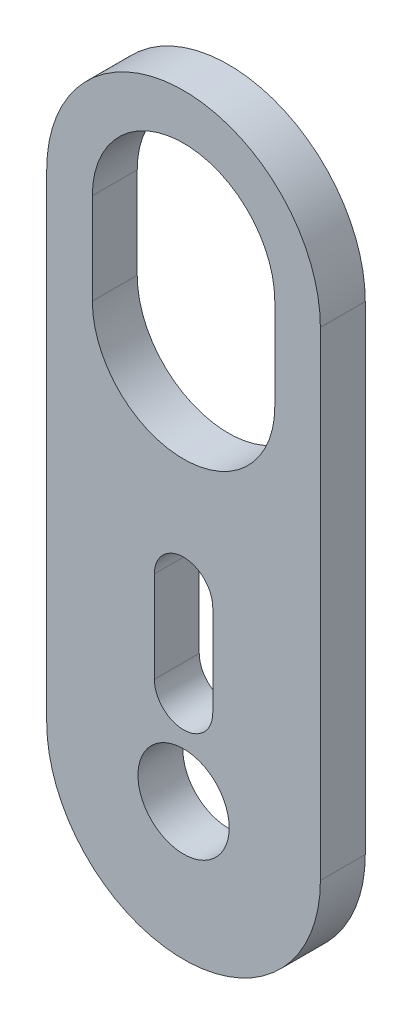
ISO-10303-21;
HEADER;
FILE_DESCRIPTION(('STEP AP214'),'2;1');
FILE_NAME('part.step','',(''),(''),'','','');
FILE_SCHEMA(('AUTOMOTIVE_DESIGN { 1 0 10303 214 1 1 1 1 }'));
ENDSEC;
DATA;
#1=APPLICATION_CONTEXT('core data for automotive mechanical design processes');
#2=APPLICATION_PROTOCOL_DEFINITION('international standard','automotive_design',2000,#1);
#3=PRODUCT_CONTEXT('',#1,'mechanical');
#4=PRODUCT('Part','Part','',(#3));
#5=PRODUCT_RELATED_PRODUCT_CATEGORY('part','',(#4));
#6=PRODUCT_DEFINITION_FORMATION('','',#4);
#7=PRODUCT_DEFINITION_CONTEXT('part definition',#1,'design');
#8=PRODUCT_DEFINITION('design','',#6,#7);
#9=PRODUCT_DEFINITION_SHAPE('','',#8);
#10=(LENGTH_UNIT() NAMED_UNIT(*) SI_UNIT(.MILLI.,.METRE.));
#11=(NAMED_UNIT(*) PLANE_ANGLE_UNIT() SI_UNIT($,.RADIAN.));
#12=(NAMED_UNIT(*) SI_UNIT($,.STERADIAN.) SOLID_ANGLE_UNIT());
#13=UNCERTAINTY_MEASURE_WITH_UNIT(LENGTH_MEASURE(1.E-05),#10,'distance_accuracy_value','');
#14=(GEOMETRIC_REPRESENTATION_CONTEXT(3) GLOBAL_UNCERTAINTY_ASSIGNED_CONTEXT((#13)) GLOBAL_UNIT_ASSIGNED_CONTEXT((#10,
#11,#12)) REPRESENTATION_CONTEXT('',''));
#15=CARTESIAN_POINT('',(0.,0.,0.));
#16=DIRECTION('',(0.,0.,1.));
#17=DIRECTION('',(1.,0.,0.));
#18=AXIS2_PLACEMENT_3D('',#15,#16,#17);
#19=CARTESIAN_POINT('',(0.,0.,3.1242));
#20=DIRECTION('',(0.,0.,1.));
#21=DIRECTION('',(1.,0.,0.));
#22=AXIS2_PLACEMENT_3D('',#19,#20,#21);
#23=PLANE('',#22);
#24=CARTESIAN_POINT('',(0.,0.,3.1242));
#25=DIRECTION('',(0.,0.,1.));
#26=DIRECTION('',(1.,0.,0.));
#27=AXIS2_PLACEMENT_3D('',#24,#25,#26);
#28=CIRCLE('',#27,9.525);
#29=CARTESIAN_POINT('',(-9.525,0.,3.1242));
#30=VERTEX_POINT('',#29);
#31=CARTESIAN_POINT('',(9.525,0.,3.1242));
#32=VERTEX_POINT('',#31);
#33=EDGE_CURVE('E197',#30,#32,#28,.T.);
#34=ORIENTED_EDGE('',*,*,#33,.T.);
#35=DIRECTION('',(0.,1.,0.));
#36=VECTOR('',#35,1.);
#37=CARTESIAN_POINT('',(9.525,0.,3.1242));
#38=LINE('',#37,#36);
#39=CARTESIAN_POINT('',(9.525,33.3375,3.1242));
#40=VERTEX_POINT('',#39);
#41=EDGE_CURVE('E200',#32,#40,#38,.T.);
#42=ORIENTED_EDGE('',*,*,#41,.T.);
#43=CARTESIAN_POINT('',(0.,33.3375,3.1242));
#44=DIRECTION('',(0.,0.,1.));
#45=DIRECTION('',(1.,0.,0.));
#46=AXIS2_PLACEMENT_3D('',#43,#44,#45);
#47=CIRCLE('',#46,9.525);
#48=CARTESIAN_POINT('',(-9.525,33.3375,3.1242));
#49=VERTEX_POINT('',#48);
#50=EDGE_CURVE('E203',#40,#49,#47,.T.);
#51=ORIENTED_EDGE('',*,*,#50,.T.);
#52=DIRECTION('',(0.,-1.,0.));
#53=VECTOR('',#52,1.);
#54=CARTESIAN_POINT('',(-9.525,0.,3.1242));
#55=LINE('',#54,#53);
#56=EDGE_CURVE('E205',#49,#30,#55,.T.);
#57=ORIENTED_EDGE('',*,*,#56,.T.);
#58=EDGE_LOOP('',(#34,#42,#51,#57));
#59=FACE_BOUND('',#58,.T.);
#60=CARTESIAN_POINT('',(0.,0.,3.1242));
#61=DIRECTION('',(0.,0.,1.));
#62=DIRECTION('',(1.,0.,0.));
#63=AXIS2_PLACEMENT_3D('',#60,#61,#62);
#64=CIRCLE('',#63,3.175);
#65=CARTESIAN_POINT('',(3.175,0.,3.1242));
#66=VERTEX_POINT('',#65);
#67=EDGE_CURVE('E191',#66,#66,#64,.T.);
#68=ORIENTED_EDGE('',*,*,#67,.F.);
#69=EDGE_LOOP('',(#68));
#70=FACE_BOUND('',#69,.T.);
#71=DIRECTION('',(0.,1.,0.));
#72=VECTOR('',#71,1.);
#73=CARTESIAN_POINT('',(2.032,6.35,3.1242));
#74=LINE('',#73,#72);
#75=CARTESIAN_POINT('',(2.032,6.35,3.1242));
#76=VERTEX_POINT('',#75);
#77=CARTESIAN_POINT('',(2.032,12.7,3.1242));
#78=VERTEX_POINT('',#77);
#79=EDGE_CURVE('E162',#76,#78,#74,.T.);
#80=ORIENTED_EDGE('',*,*,#79,.F.);
#81=CARTESIAN_POINT('',(0.,6.35,3.1242));
#82=DIRECTION('',(0.,0.,1.));
#83=DIRECTION('',(1.,0.,0.));
#84=AXIS2_PLACEMENT_3D('',#81,#82,#83);
#85=CIRCLE('',#84,2.032);
#86=CARTESIAN_POINT('',(-2.032,6.35,3.1242));
#87=VERTEX_POINT('',#86);
#88=EDGE_CURVE('E160',#87,#76,#85,.T.);
#89=ORIENTED_EDGE('',*,*,#88,.F.);
#90=DIRECTION('',(0.,-1.,0.));
#91=VECTOR('',#90,1.);
#92=CARTESIAN_POINT('',(-2.032,6.35,3.1242));
#93=LINE('',#92,#91);
#94=CARTESIAN_POINT('',(-2.032,12.7,3.1242));
#95=VERTEX_POINT('',#94);
#96=EDGE_CURVE('E168',#95,#87,#93,.T.);
#97=ORIENTED_EDGE('',*,*,#96,.F.);
#98=CARTESIAN_POINT('',(0.,12.7,3.1242));
#99=DIRECTION('',(0.,0.,1.));
#100=DIRECTION('',(1.,0.,0.));
#101=AXIS2_PLACEMENT_3D('',#98,#99,#100);
#102=CIRCLE('',#101,2.032);
#103=EDGE_CURVE('E165',#78,#95,#102,.T.);
#104=ORIENTED_EDGE('',*,*,#103,.F.);
#105=EDGE_LOOP('',(#80,#89,#97,#104));
#106=FACE_BOUND('',#105,.T.);
#107=DIRECTION('',(0.,-1.,0.));
#108=VECTOR('',#107,1.);
#109=CARTESIAN_POINT('',(-6.35,33.3375,3.1242));
#110=LINE('',#109,#108);
#111=CARTESIAN_POINT('',(-6.35,33.3375,3.1242));
#112=VERTEX_POINT('',#111);
#113=CARTESIAN_POINT('',(-6.35,26.9875,3.1242));
#114=VERTEX_POINT('',#113);
#115=EDGE_CURVE('E132',#112,#114,#110,.T.);
#116=ORIENTED_EDGE('',*,*,#115,.F.);
#117=CARTESIAN_POINT('',(0.,33.3375,3.1242));
#118=DIRECTION('',(0.,0.,1.));
#119=DIRECTION('',(1.,0.,0.));
#120=AXIS2_PLACEMENT_3D('',#117,#118,#119);
#121=CIRCLE('',#120,6.35);
#122=CARTESIAN_POINT('',(6.35,33.3375,3.1242));
#123=VERTEX_POINT('',#122);
#124=EDGE_CURVE('E124',#123,#112,#121,.T.);
#125=ORIENTED_EDGE('',*,*,#124,.F.);
#126=DIRECTION('',(0.,1.,0.));
#127=VECTOR('',#126,1.);
#128=CARTESIAN_POINT('',(6.35,33.3375,3.1242));
#129=LINE('',#128,#127);
#130=CARTESIAN_POINT('',(6.35,26.9875,3.1242));
#131=VERTEX_POINT('',#130);
#132=EDGE_CURVE('E146',#131,#123,#129,.T.);
#133=ORIENTED_EDGE('',*,*,#132,.F.);
#134=CARTESIAN_POINT('',(0.,26.9875,3.1242));
#135=DIRECTION('',(0.,0.,1.));
#136=DIRECTION('',(1.,0.,0.));
#137=AXIS2_PLACEMENT_3D('',#134,#135,#136);
#138=CIRCLE('',#137,6.35);
#139=EDGE_CURVE('E144',#114,#131,#138,.T.);
#140=ORIENTED_EDGE('',*,*,#139,.F.);
#141=EDGE_LOOP('',(#116,#125,#133,#140));
#142=FACE_BOUND('',#141,.T.);
#143=ADVANCED_FACE('F35',(#59,#70,#106,#142),#23,.T.);
#144=CARTESIAN_POINT('',(0.,0.,0.));
#145=DIRECTION('',(0.,0.,1.));
#146=DIRECTION('',(1.,0.,0.));
#147=AXIS2_PLACEMENT_3D('',#144,#145,#146);
#148=PLANE('',#147);
#149=CARTESIAN_POINT('',(0.,6.35,0.));
#150=DIRECTION('',(0.,0.,1.));
#151=DIRECTION('',(1.,0.,0.));
#152=AXIS2_PLACEMENT_3D('',#149,#150,#151);
#153=CIRCLE('',#152,2.032);
#154=CARTESIAN_POINT('',(-2.032,6.35,0.));
#155=VERTEX_POINT('',#154);
#156=CARTESIAN_POINT('',(2.032,6.35,0.));
#157=VERTEX_POINT('',#156);
#158=EDGE_CURVE('E140',#155,#157,#153,.T.);
#159=ORIENTED_EDGE('',*,*,#158,.T.);
#160=DIRECTION('',(0.,1.,0.));
#161=VECTOR('',#160,1.);
#162=CARTESIAN_POINT('',(2.032,6.35,0.));
#163=LINE('',#162,#161);
#164=CARTESIAN_POINT('',(2.032,12.7,0.));
#165=VERTEX_POINT('',#164);
#166=EDGE_CURVE('E173',#157,#165,#163,.T.);
#167=ORIENTED_EDGE('',*,*,#166,.T.);
#168=CARTESIAN_POINT('',(0.,12.7,0.));
#169=DIRECTION('',(0.,0.,1.));
#170=DIRECTION('',(1.,0.,0.));
#171=AXIS2_PLACEMENT_3D('',#168,#169,#170);
#172=CIRCLE('',#171,2.032);
#173=CARTESIAN_POINT('',(-2.032,12.7,0.));
#174=VERTEX_POINT('',#173);
#175=EDGE_CURVE('E176',#165,#174,#172,.T.);
#176=ORIENTED_EDGE('',*,*,#175,.T.);
#177=DIRECTION('',(0.,-1.,0.));
#178=VECTOR('',#177,1.);
#179=CARTESIAN_POINT('',(-2.032,6.35,0.));
#180=LINE('',#179,#178);
#181=EDGE_CURVE('E163',#174,#155,#180,.T.);
#182=ORIENTED_EDGE('',*,*,#181,.T.);
#183=EDGE_LOOP('',(#159,#167,#176,#182));
#184=FACE_BOUND('',#183,.T.);
#185=CARTESIAN_POINT('',(0.,0.,0.));
#186=DIRECTION('',(0.,0.,1.));
#187=DIRECTION('',(1.,0.,0.));
#188=AXIS2_PLACEMENT_3D('',#185,#186,#187);
#189=CIRCLE('',#188,9.525);
#190=CARTESIAN_POINT('',(-9.525,0.,0.));
#191=VERTEX_POINT('',#190);
#192=CARTESIAN_POINT('',(9.525,0.,0.));
#193=VERTEX_POINT('',#192);
#194=EDGE_CURVE('E194',#191,#193,#189,.T.);
#195=ORIENTED_EDGE('',*,*,#194,.F.);
#196=DIRECTION('',(0.,-1.,0.));
#197=VECTOR('',#196,1.);
#198=CARTESIAN_POINT('',(-9.525,0.,0.));
#199=LINE('',#198,#197);
#200=CARTESIAN_POINT('',(-9.525,33.3375,0.));
#201=VERTEX_POINT('',#200);
#202=EDGE_CURVE('E201',#201,#191,#199,.T.);
#203=ORIENTED_EDGE('',*,*,#202,.F.);
#204=CARTESIAN_POINT('',(0.,33.3375,0.));
#205=DIRECTION('',(0.,0.,1.));
#206=DIRECTION('',(1.,0.,0.));
#207=AXIS2_PLACEMENT_3D('',#204,#205,#206);
#208=CIRCLE('',#207,9.525);
#209=CARTESIAN_POINT('',(9.525,33.3375,0.));
#210=VERTEX_POINT('',#209);
#211=EDGE_CURVE('E212',#210,#201,#208,.T.);
#212=ORIENTED_EDGE('',*,*,#211,.F.);
#213=DIRECTION('',(0.,1.,0.));
#214=VECTOR('',#213,1.);
#215=CARTESIAN_POINT('',(9.525,0.,0.));
#216=LINE('',#215,#214);
#217=EDGE_CURVE('E210',#193,#210,#216,.T.);
#218=ORIENTED_EDGE('',*,*,#217,.F.);
#219=EDGE_LOOP('',(#195,#203,#212,#218));
#220=FACE_BOUND('',#219,.T.);
#221=CARTESIAN_POINT('',(0.,0.,0.));
#222=DIRECTION('',(0.,0.,1.));
#223=DIRECTION('',(1.,0.,0.));
#224=AXIS2_PLACEMENT_3D('',#221,#222,#223);
#225=CIRCLE('',#224,3.175);
#226=CARTESIAN_POINT('',(3.175,0.,0.));
#227=VERTEX_POINT('',#226);
#228=EDGE_CURVE('E190',#227,#227,#225,.T.);
#229=ORIENTED_EDGE('',*,*,#228,.T.);
#230=EDGE_LOOP('',(#229));
#231=FACE_BOUND('',#230,.T.);
#232=CARTESIAN_POINT('',(0.,33.3375,0.));
#233=DIRECTION('',(0.,0.,1.));
#234=DIRECTION('',(1.,0.,0.));
#235=AXIS2_PLACEMENT_3D('',#232,#233,#234);
#236=CIRCLE('',#235,6.35);
#237=CARTESIAN_POINT('',(6.35,33.3375,0.));
#238=VERTEX_POINT('',#237);
#239=CARTESIAN_POINT('',(-6.35,33.3375,0.));
#240=VERTEX_POINT('',#239);
#241=EDGE_CURVE('E58',#238,#240,#236,.T.);
#242=ORIENTED_EDGE('',*,*,#241,.T.);
#243=DIRECTION('',(0.,-1.,0.));
#244=VECTOR('',#243,1.);
#245=CARTESIAN_POINT('',(-6.35,33.3375,0.));
#246=LINE('',#245,#244);
#247=CARTESIAN_POINT('',(-6.35,26.9875,0.));
#248=VERTEX_POINT('',#247);
#249=EDGE_CURVE('E139',#240,#248,#246,.T.);
#250=ORIENTED_EDGE('',*,*,#249,.T.);
#251=CARTESIAN_POINT('',(0.,26.9875,0.));
#252=DIRECTION('',(0.,0.,1.));
#253=DIRECTION('',(1.,0.,0.));
#254=AXIS2_PLACEMENT_3D('',#251,#252,#253);
#255=CIRCLE('',#254,6.35);
#256=CARTESIAN_POINT('',(6.35,26.9875,0.));
#257=VERTEX_POINT('',#256);
#258=EDGE_CURVE('E152',#248,#257,#255,.T.);
#259=ORIENTED_EDGE('',*,*,#258,.T.);
#260=DIRECTION('',(0.,1.,0.));
#261=VECTOR('',#260,1.);
#262=CARTESIAN_POINT('',(6.35,33.3375,0.));
#263=LINE('',#262,#261);
#264=EDGE_CURVE('E133',#257,#238,#263,.T.);
#265=ORIENTED_EDGE('',*,*,#264,.T.);
#266=EDGE_LOOP('',(#242,#250,#259,#265));
#267=FACE_BOUND('',#266,.T.);
#268=ADVANCED_FACE('F230',(#184,#220,#231,#267),#148,.F.);
#269=CARTESIAN_POINT('',(0.,0.,3.1242));
#270=DIRECTION('',(0.,0.,-1.));
#271=DIRECTION('',(-1.,0.,0.));
#272=AXIS2_PLACEMENT_3D('',#269,#270,#271);
#273=CYLINDRICAL_SURFACE('',#272,9.525);
#274=ORIENTED_EDGE('',*,*,#194,.T.);
#275=DIRECTION('',(0.,0.,-1.));
#276=VECTOR('',#275,1.);
#277=CARTESIAN_POINT('',(9.525,0.,3.1242));
#278=LINE('',#277,#276);
#279=EDGE_CURVE('E11',#32,#193,#278,.T.);
#280=ORIENTED_EDGE('',*,*,#279,.F.);
#281=ORIENTED_EDGE('',*,*,#33,.F.);
#282=DIRECTION('',(0.,0.,-1.));
#283=VECTOR('',#282,1.);
#284=CARTESIAN_POINT('',(-9.525,0.,3.1242));
#285=LINE('',#284,#283);
#286=EDGE_CURVE('E207',#30,#191,#285,.T.);
#287=ORIENTED_EDGE('',*,*,#286,.T.);
#288=EDGE_LOOP('',(#274,#280,#281,#287));
#289=FACE_BOUND('',#288,.T.);
#290=ADVANCED_FACE('F37',(#289),#273,.T.);
#291=CARTESIAN_POINT('',(9.525,0.,3.1242));
#292=DIRECTION('',(-1.,0.,0.));
#293=DIRECTION('',(0.,0.,1.));
#294=AXIS2_PLACEMENT_3D('',#291,#292,#293);
#295=PLANE('',#294);
#296=ORIENTED_EDGE('',*,*,#217,.T.);
#297=DIRECTION('',(0.,0.,-1.));
#298=VECTOR('',#297,1.);
#299=CARTESIAN_POINT('',(9.525,33.3375,3.1242));
#300=LINE('',#299,#298);
#301=EDGE_CURVE('E43',#40,#210,#300,.T.);
#302=ORIENTED_EDGE('',*,*,#301,.F.);
#303=ORIENTED_EDGE('',*,*,#41,.F.);
#304=ORIENTED_EDGE('',*,*,#279,.T.);
#305=EDGE_LOOP('',(#296,#302,#303,#304));
#306=FACE_BOUND('',#305,.T.);
#307=ADVANCED_FACE('F241',(#306),#295,.F.);
#308=CARTESIAN_POINT('',(0.,33.3375,3.1242));
#309=DIRECTION('',(0.,0.,-1.));
#310=DIRECTION('',(-1.,0.,0.));
#311=AXIS2_PLACEMENT_3D('',#308,#309,#310);
#312=CYLINDRICAL_SURFACE('',#311,9.525);
#313=ORIENTED_EDGE('',*,*,#211,.T.);
#314=DIRECTION('',(0.,0.,-1.));
#315=VECTOR('',#314,1.);
#316=CARTESIAN_POINT('',(-9.525,33.3375,3.1242));
#317=LINE('',#316,#315);
#318=EDGE_CURVE('E217',#49,#201,#317,.T.);
#319=ORIENTED_EDGE('',*,*,#318,.F.);
#320=ORIENTED_EDGE('',*,*,#50,.F.);
#321=ORIENTED_EDGE('',*,*,#301,.T.);
#322=EDGE_LOOP('',(#313,#319,#320,#321));
#323=FACE_BOUND('',#322,.T.);
#324=ADVANCED_FACE('F224',(#323),#312,.T.);
#325=CARTESIAN_POINT('',(-9.525,0.,3.1242));
#326=DIRECTION('',(1.,0.,0.));
#327=DIRECTION('',(0.,0.,-1.));
#328=AXIS2_PLACEMENT_3D('',#325,#326,#327);
#329=PLANE('',#328);
#330=ORIENTED_EDGE('',*,*,#202,.T.);
#331=ORIENTED_EDGE('',*,*,#286,.F.);
#332=ORIENTED_EDGE('',*,*,#56,.F.);
#333=ORIENTED_EDGE('',*,*,#318,.T.);
#334=EDGE_LOOP('',(#330,#331,#332,#333));
#335=FACE_BOUND('',#334,.T.);
#336=ADVANCED_FACE('F234',(#335),#329,.F.);
#337=CARTESIAN_POINT('',(0.,0.,3.1242));
#338=DIRECTION('',(0.,0.,-1.));
#339=DIRECTION('',(-1.,0.,0.));
#340=AXIS2_PLACEMENT_3D('',#337,#338,#339);
#341=CYLINDRICAL_SURFACE('',#340,3.175);
#342=ORIENTED_EDGE('',*,*,#67,.T.);
#343=EDGE_LOOP('',(#342));
#344=FACE_BOUND('',#343,.T.);
#345=ORIENTED_EDGE('',*,*,#228,.F.);
#346=EDGE_LOOP('',(#345));
#347=FACE_BOUND('',#346,.T.);
#348=ADVANCED_FACE('F256',(#344,#347),#341,.F.);
#349=CARTESIAN_POINT('',(0.,6.35,3.1242));
#350=DIRECTION('',(0.,0.,-1.));
#351=DIRECTION('',(-1.,0.,0.));
#352=AXIS2_PLACEMENT_3D('',#349,#350,#351);
#353=CYLINDRICAL_SURFACE('',#352,2.032);
#354=ORIENTED_EDGE('',*,*,#158,.F.);
#355=DIRECTION('',(0.,0.,-1.));
#356=VECTOR('',#355,1.);
#357=CARTESIAN_POINT('',(-2.032,6.35,3.1242));
#358=LINE('',#357,#356);
#359=EDGE_CURVE('E170',#87,#155,#358,.T.);
#360=ORIENTED_EDGE('',*,*,#359,.F.);
#361=ORIENTED_EDGE('',*,*,#88,.T.);
#362=DIRECTION('',(0.,0.,-1.));
#363=VECTOR('',#362,1.);
#364=CARTESIAN_POINT('',(2.032,6.35,3.1242));
#365=LINE('',#364,#363);
#366=EDGE_CURVE('E187',#76,#157,#365,.T.);
#367=ORIENTED_EDGE('',*,*,#366,.T.);
#368=EDGE_LOOP('',(#354,#360,#361,#367));
#369=FACE_BOUND('',#368,.T.);
#370=ADVANCED_FACE('F263',(#369),#353,.F.);
#371=CARTESIAN_POINT('',(2.032,6.35,3.1242));
#372=DIRECTION('',(-1.,0.,0.));
#373=DIRECTION('',(0.,0.,1.));
#374=AXIS2_PLACEMENT_3D('',#371,#372,#373);
#375=PLANE('',#374);
#376=ORIENTED_EDGE('',*,*,#166,.F.);
#377=ORIENTED_EDGE('',*,*,#366,.F.);
#378=ORIENTED_EDGE('',*,*,#79,.T.);
#379=DIRECTION('',(0.,0.,-1.));
#380=VECTOR('',#379,1.);
#381=CARTESIAN_POINT('',(2.032,12.7,3.1242));
#382=LINE('',#381,#380);
#383=EDGE_CURVE('E185',#78,#165,#382,.T.);
#384=ORIENTED_EDGE('',*,*,#383,.T.);
#385=EDGE_LOOP('',(#376,#377,#378,#384));
#386=FACE_BOUND('',#385,.T.);
#387=ADVANCED_FACE('F268',(#386),#375,.T.);
#388=CARTESIAN_POINT('',(0.,12.7,3.1242));
#389=DIRECTION('',(0.,0.,-1.));
#390=DIRECTION('',(-1.,0.,0.));
#391=AXIS2_PLACEMENT_3D('',#388,#389,#390);
#392=CYLINDRICAL_SURFACE('',#391,2.032);
#393=ORIENTED_EDGE('',*,*,#175,.F.);
#394=ORIENTED_EDGE('',*,*,#383,.F.);
#395=ORIENTED_EDGE('',*,*,#103,.T.);
#396=DIRECTION('',(0.,0.,-1.));
#397=VECTOR('',#396,1.);
#398=CARTESIAN_POINT('',(-2.032,12.7,3.1242));
#399=LINE('',#398,#397);
#400=EDGE_CURVE('E183',#95,#174,#399,.T.);
#401=ORIENTED_EDGE('',*,*,#400,.T.);
#402=EDGE_LOOP('',(#393,#394,#395,#401));
#403=FACE_BOUND('',#402,.T.);
#404=ADVANCED_FACE('F292',(#403),#392,.F.);
#405=CARTESIAN_POINT('',(-2.032,6.35,3.1242));
#406=DIRECTION('',(1.,0.,0.));
#407=DIRECTION('',(0.,0.,-1.));
#408=AXIS2_PLACEMENT_3D('',#405,#406,#407);
#409=PLANE('',#408);
#410=ORIENTED_EDGE('',*,*,#181,.F.);
#411=ORIENTED_EDGE('',*,*,#400,.F.);
#412=ORIENTED_EDGE('',*,*,#96,.T.);
#413=ORIENTED_EDGE('',*,*,#359,.T.);
#414=EDGE_LOOP('',(#410,#411,#412,#413));
#415=FACE_BOUND('',#414,.T.);
#416=ADVANCED_FACE('F289',(#415),#409,.T.);
#417=CARTESIAN_POINT('',(0.,33.3375,3.1242));
#418=DIRECTION('',(0.,0.,-1.));
#419=DIRECTION('',(-1.,0.,0.));
#420=AXIS2_PLACEMENT_3D('',#417,#418,#419);
#421=CYLINDRICAL_SURFACE('',#420,6.35);
#422=ORIENTED_EDGE('',*,*,#241,.F.);
#423=DIRECTION('',(0.,0.,-1.));
#424=VECTOR('',#423,1.);
#425=CARTESIAN_POINT('',(6.35,33.3375,3.1242));
#426=LINE('',#425,#424);
#427=EDGE_CURVE('E128',#123,#238,#426,.T.);
#428=ORIENTED_EDGE('',*,*,#427,.F.);
#429=ORIENTED_EDGE('',*,*,#124,.T.);
#430=DIRECTION('',(0.,0.,-1.));
#431=VECTOR('',#430,1.);
#432=CARTESIAN_POINT('',(-6.35,33.3375,3.1242));
#433=LINE('',#432,#431);
#434=EDGE_CURVE('E127',#112,#240,#433,.T.);
#435=ORIENTED_EDGE('',*,*,#434,.T.);
#436=EDGE_LOOP('',(#422,#428,#429,#435));
#437=FACE_BOUND('',#436,.T.);
#438=ADVANCED_FACE('F126',(#437),#421,.F.);
#439=CARTESIAN_POINT('',(-6.35,33.3375,3.1242));
#440=DIRECTION('',(1.,0.,0.));
#441=DIRECTION('',(0.,0.,-1.));
#442=AXIS2_PLACEMENT_3D('',#439,#440,#441);
#443=PLANE('',#442);
#444=ORIENTED_EDGE('',*,*,#249,.F.);
#445=ORIENTED_EDGE('',*,*,#434,.F.);
#446=ORIENTED_EDGE('',*,*,#115,.T.);
#447=DIRECTION('',(0.,0.,-1.));
#448=VECTOR('',#447,1.);
#449=CARTESIAN_POINT('',(-6.35,26.9875,3.1242));
#450=LINE('',#449,#448);
#451=EDGE_CURVE('E141',#114,#248,#450,.T.);
#452=ORIENTED_EDGE('',*,*,#451,.T.);
#453=EDGE_LOOP('',(#444,#445,#446,#452));
#454=FACE_BOUND('',#453,.T.);
#455=ADVANCED_FACE('F136',(#454),#443,.T.);
#456=CARTESIAN_POINT('',(0.,26.9875,3.1242));
#457=DIRECTION('',(0.,0.,-1.));
#458=DIRECTION('',(-1.,0.,0.));
#459=AXIS2_PLACEMENT_3D('',#456,#457,#458);
#460=CYLINDRICAL_SURFACE('',#459,6.35);
#461=ORIENTED_EDGE('',*,*,#258,.F.);
#462=ORIENTED_EDGE('',*,*,#451,.F.);
#463=ORIENTED_EDGE('',*,*,#139,.T.);
#464=DIRECTION('',(0.,0.,-1.));
#465=VECTOR('',#464,1.);
#466=CARTESIAN_POINT('',(6.35,26.9875,3.1242));
#467=LINE('',#466,#465);
#468=EDGE_CURVE('E50',#131,#257,#467,.T.);
#469=ORIENTED_EDGE('',*,*,#468,.T.);
#470=EDGE_LOOP('',(#461,#462,#463,#469));
#471=FACE_BOUND('',#470,.T.);
#472=ADVANCED_FACE('F277',(#471),#460,.F.);
#473=CARTESIAN_POINT('',(6.35,33.3375,3.1242));
#474=DIRECTION('',(-1.,0.,0.));
#475=DIRECTION('',(0.,-1.,0.));
#476=AXIS2_PLACEMENT_3D('',#473,#474,#475);
#477=PLANE('',#476);
#478=ORIENTED_EDGE('',*,*,#264,.F.);
#479=ORIENTED_EDGE('',*,*,#468,.F.);
#480=ORIENTED_EDGE('',*,*,#132,.T.);
#481=ORIENTED_EDGE('',*,*,#427,.T.);
#482=EDGE_LOOP('',(#478,#479,#480,#481));
#483=FACE_BOUND('',#482,.T.);
#484=ADVANCED_FACE('F275',(#483),#477,.T.);
#485=CLOSED_SHELL('',(#143,#268,#290,#307,#324,#336,#348,#370,#387,#404,#416,#438,#455,#472,#484));
#486=MANIFOLD_SOLID_BREP('B2',#485);
#487=ADVANCED_BREP_SHAPE_REPRESENTATION('',(#18,#486),#14);
#488=SHAPE_DEFINITION_REPRESENTATION(#9,#487);
ENDSEC;
END-ISO-10303-21;
